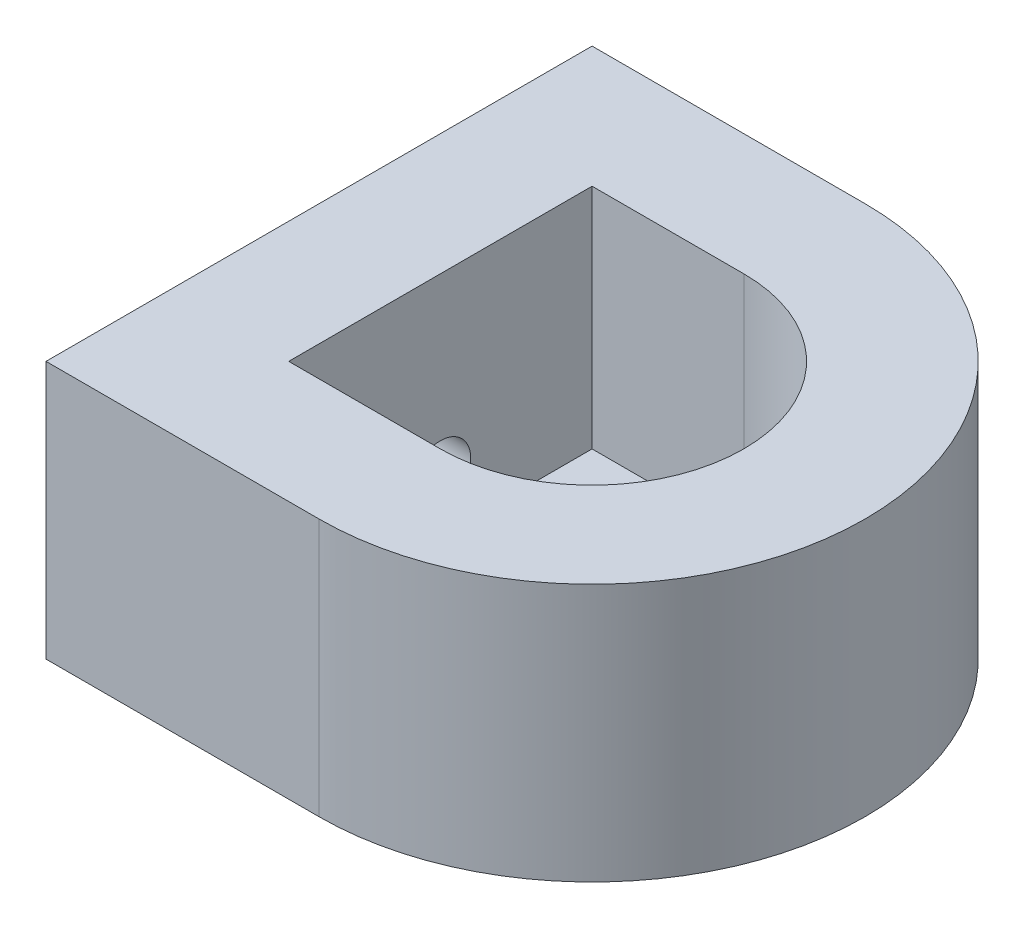
ISO-10303-21;
HEADER;
FILE_DESCRIPTION(('STEP AP214'),'2;1');
FILE_NAME('part.step','',(''),(''),'','','');
FILE_SCHEMA(('AUTOMOTIVE_DESIGN { 1 0 10303 214 1 1 1 1 }'));
ENDSEC;
DATA;
#1=APPLICATION_CONTEXT('core data for automotive mechanical design processes');
#2=APPLICATION_PROTOCOL_DEFINITION('international standard','automotive_design',2000,#1);
#3=PRODUCT_CONTEXT('',#1,'mechanical');
#4=PRODUCT('Part','Part','',(#3));
#5=PRODUCT_RELATED_PRODUCT_CATEGORY('part','',(#4));
#6=PRODUCT_DEFINITION_FORMATION('','',#4);
#7=PRODUCT_DEFINITION_CONTEXT('part definition',#1,'design');
#8=PRODUCT_DEFINITION('design','',#6,#7);
#9=PRODUCT_DEFINITION_SHAPE('','',#8);
#10=(LENGTH_UNIT() NAMED_UNIT(*) SI_UNIT(.MILLI.,.METRE.));
#11=(NAMED_UNIT(*) PLANE_ANGLE_UNIT() SI_UNIT($,.RADIAN.));
#12=(NAMED_UNIT(*) SI_UNIT($,.STERADIAN.) SOLID_ANGLE_UNIT());
#13=UNCERTAINTY_MEASURE_WITH_UNIT(LENGTH_MEASURE(1.E-05),#10,'distance_accuracy_value','');
#14=(GEOMETRIC_REPRESENTATION_CONTEXT(3) GLOBAL_UNCERTAINTY_ASSIGNED_CONTEXT((#13)) GLOBAL_UNIT_ASSIGNED_CONTEXT((#10,
#11,#12)) REPRESENTATION_CONTEXT('',''));
#15=CARTESIAN_POINT('',(0.,0.,0.));
#16=DIRECTION('',(0.,0.,1.));
#17=DIRECTION('',(1.,0.,0.));
#18=AXIS2_PLACEMENT_3D('',#15,#16,#17);
#19=CARTESIAN_POINT('',(0.,-2.,0.));
#20=DIRECTION('',(0.,-1.,0.));
#21=DIRECTION('',(0.,0.,-1.));
#22=AXIS2_PLACEMENT_3D('',#19,#20,#21);
#23=PLANE('',#22);
#24=CARTESIAN_POINT('',(5.00000000000001,-2.,0.));
#25=DIRECTION('',(0.,-1.,0.));
#26=DIRECTION('',(0.,0.,-1.));
#27=AXIS2_PLACEMENT_3D('',#24,#25,#26);
#28=CIRCLE('',#27,3.);
#29=CARTESIAN_POINT('',(5.00000000000001,-2.,-3.));
#30=VERTEX_POINT('',#29);
#31=EDGE_CURVE('E38',#30,#30,#28,.F.);
#32=ORIENTED_EDGE('',*,*,#31,.T.);
#33=EDGE_LOOP('',(#32));
#34=FACE_BOUND('',#33,.T.);
#35=DIRECTION('',(1.,0.,0.));
#36=VECTOR('',#35,1.);
#37=CARTESIAN_POINT('',(-13.,-2.,-18.));
#38=LINE('',#37,#36);
#39=CARTESIAN_POINT('',(-13.,-2.,-18.));
#40=VERTEX_POINT('',#39);
#41=CARTESIAN_POINT('',(5.00000000000001,-2.,-18.));
#42=VERTEX_POINT('',#41);
#43=EDGE_CURVE('E143',#40,#42,#38,.T.);
#44=ORIENTED_EDGE('',*,*,#43,.T.);
#45=CARTESIAN_POINT('',(5.00000000000001,-2.,0.));
#46=DIRECTION('',(0.,-1.,0.));
#47=DIRECTION('',(0.,0.,-1.));
#48=AXIS2_PLACEMENT_3D('',#45,#46,#47);
#49=CIRCLE('',#48,18.);
#50=CARTESIAN_POINT('',(5.00000000000001,-2.,18.));
#51=VERTEX_POINT('',#50);
#52=EDGE_CURVE('E141',#42,#51,#49,.T.);
#53=ORIENTED_EDGE('',*,*,#52,.T.);
#54=DIRECTION('',(1.,0.,0.));
#55=VECTOR('',#54,1.);
#56=CARTESIAN_POINT('',(-13.,-2.,18.));
#57=LINE('',#56,#55);
#58=CARTESIAN_POINT('',(-13.,-2.,18.));
#59=VERTEX_POINT('',#58);
#60=EDGE_CURVE('E138',#59,#51,#57,.T.);
#61=ORIENTED_EDGE('',*,*,#60,.F.);
#62=DIRECTION('',(0.,0.,1.));
#63=VECTOR('',#62,1.);
#64=CARTESIAN_POINT('',(-13.,-2.,-18.));
#65=LINE('',#64,#63);
#66=EDGE_CURVE('E135',#40,#59,#65,.T.);
#67=ORIENTED_EDGE('',*,*,#66,.F.);
#68=EDGE_LOOP('',(#44,#53,#61,#67));
#69=FACE_BOUND('',#68,.T.);
#70=ADVANCED_FACE('F34',(#34,#69),#23,.T.);
#71=CARTESIAN_POINT('',(-4.99999999999999,15.,10.));
#72=DIRECTION('',(0.,0.,-1.));
#73=DIRECTION('',(-1.,0.,0.));
#74=AXIS2_PLACEMENT_3D('',#71,#72,#73);
#75=PLANE('',#74);
#76=DIRECTION('',(1.,0.,0.));
#77=VECTOR('',#76,1.);
#78=CARTESIAN_POINT('',(-4.99999999999999,0.,10.));
#79=LINE('',#78,#77);
#80=CARTESIAN_POINT('',(-4.99999999999999,0.,10.));
#81=VERTEX_POINT('',#80);
#82=CARTESIAN_POINT('',(5.00000000000001,0.,10.));
#83=VERTEX_POINT('',#82);
#84=EDGE_CURVE('E109',#81,#83,#79,.T.);
#85=ORIENTED_EDGE('',*,*,#84,.F.);
#86=DIRECTION('',(0.,-1.,0.));
#87=VECTOR('',#86,1.);
#88=CARTESIAN_POINT('',(-4.99999999999999,15.,10.));
#89=LINE('',#88,#87);
#90=CARTESIAN_POINT('',(-4.99999999999999,15.,10.));
#91=VERTEX_POINT('',#90);
#92=EDGE_CURVE('E102',#91,#81,#89,.T.);
#93=ORIENTED_EDGE('',*,*,#92,.F.);
#94=DIRECTION('',(1.,0.,0.));
#95=VECTOR('',#94,1.);
#96=CARTESIAN_POINT('',(-4.99999999999999,15.,10.));
#97=LINE('',#96,#95);
#98=CARTESIAN_POINT('',(5.00000000000001,15.,10.));
#99=VERTEX_POINT('',#98);
#100=EDGE_CURVE('E106',#91,#99,#97,.T.);
#101=ORIENTED_EDGE('',*,*,#100,.T.);
#102=DIRECTION('',(0.,-1.,0.));
#103=VECTOR('',#102,1.);
#104=CARTESIAN_POINT('',(5.00000000000001,15.,10.));
#105=LINE('',#104,#103);
#106=EDGE_CURVE('E113',#99,#83,#105,.T.);
#107=ORIENTED_EDGE('',*,*,#106,.T.);
#108=EDGE_LOOP('',(#85,#93,#101,#107));
#109=FACE_BOUND('',#108,.T.);
#110=ADVANCED_FACE('F104',(#109),#75,.T.);
#111=CARTESIAN_POINT('',(-4.99999999999999,15.,-10.));
#112=DIRECTION('',(1.,0.,0.));
#113=DIRECTION('',(0.,0.,-1.));
#114=AXIS2_PLACEMENT_3D('',#111,#112,#113);
#115=PLANE('',#114);
#116=CARTESIAN_POINT('',(-4.99999999999999,3.47,0.));
#117=DIRECTION('',(1.,0.,0.));
#118=DIRECTION('',(0.,0.,-1.));
#119=AXIS2_PLACEMENT_3D('',#116,#117,#118);
#120=CIRCLE('',#119,2.);
#121=CARTESIAN_POINT('',(-4.99999999999999,3.47,-2.));
#122=VERTEX_POINT('',#121);
#123=EDGE_CURVE('E43',#122,#122,#120,.T.);
#124=ORIENTED_EDGE('',*,*,#123,.F.);
#125=EDGE_LOOP('',(#124));
#126=FACE_BOUND('',#125,.T.);
#127=DIRECTION('',(0.,0.,1.));
#128=VECTOR('',#127,1.);
#129=CARTESIAN_POINT('',(-4.99999999999999,0.,-10.));
#130=LINE('',#129,#128);
#131=CARTESIAN_POINT('',(-4.99999999999999,0.,-10.));
#132=VERTEX_POINT('',#131);
#133=EDGE_CURVE('E175',#132,#81,#130,.T.);
#134=ORIENTED_EDGE('',*,*,#133,.F.);
#135=DIRECTION('',(0.,-1.,0.));
#136=VECTOR('',#135,1.);
#137=CARTESIAN_POINT('',(-4.99999999999999,15.,-10.));
#138=LINE('',#137,#136);
#139=CARTESIAN_POINT('',(-4.99999999999999,15.,-10.));
#140=VERTEX_POINT('',#139);
#141=EDGE_CURVE('E114',#140,#132,#138,.T.);
#142=ORIENTED_EDGE('',*,*,#141,.F.);
#143=DIRECTION('',(0.,0.,1.));
#144=VECTOR('',#143,1.);
#145=CARTESIAN_POINT('',(-4.99999999999999,15.,-10.));
#146=LINE('',#145,#144);
#147=EDGE_CURVE('E118',#140,#91,#146,.T.);
#148=ORIENTED_EDGE('',*,*,#147,.T.);
#149=ORIENTED_EDGE('',*,*,#92,.T.);
#150=EDGE_LOOP('',(#134,#142,#148,#149));
#151=FACE_BOUND('',#150,.T.);
#152=ADVANCED_FACE('F119',(#126,#151),#115,.T.);
#153=CARTESIAN_POINT('',(-4.99999999999999,15.,-10.));
#154=DIRECTION('',(0.,0.,1.));
#155=DIRECTION('',(1.,0.,0.));
#156=AXIS2_PLACEMENT_3D('',#153,#154,#155);
#157=PLANE('',#156);
#158=DIRECTION('',(-1.,0.,0.));
#159=VECTOR('',#158,1.);
#160=CARTESIAN_POINT('',(-4.99999999999999,0.,-10.));
#161=LINE('',#160,#159);
#162=CARTESIAN_POINT('',(5.,0.,-10.));
#163=VERTEX_POINT('',#162);
#164=EDGE_CURVE('E176',#163,#132,#161,.T.);
#165=ORIENTED_EDGE('',*,*,#164,.F.);
#166=DIRECTION('',(0.,-1.,0.));
#167=VECTOR('',#166,1.);
#168=CARTESIAN_POINT('',(5.,15.,-10.));
#169=LINE('',#168,#167);
#170=CARTESIAN_POINT('',(5.,15.,-10.));
#171=VERTEX_POINT('',#170);
#172=EDGE_CURVE('E170',#171,#163,#169,.T.);
#173=ORIENTED_EDGE('',*,*,#172,.F.);
#174=DIRECTION('',(-1.,0.,0.));
#175=VECTOR('',#174,1.);
#176=CARTESIAN_POINT('',(-4.99999999999999,15.,-10.));
#177=LINE('',#176,#175);
#178=EDGE_CURVE('E122',#171,#140,#177,.T.);
#179=ORIENTED_EDGE('',*,*,#178,.T.);
#180=ORIENTED_EDGE('',*,*,#141,.T.);
#181=EDGE_LOOP('',(#165,#173,#179,#180));
#182=FACE_BOUND('',#181,.T.);
#183=ADVANCED_FACE('F186',(#182),#157,.T.);
#184=CARTESIAN_POINT('',(5.00000000000001,15.,0.));
#185=DIRECTION('',(0.,-1.,0.));
#186=DIRECTION('',(0.,0.,-1.));
#187=AXIS2_PLACEMENT_3D('',#184,#185,#186);
#188=CYLINDRICAL_SURFACE('',#187,10.);
#189=CARTESIAN_POINT('',(5.00000000000001,0.,0.));
#190=DIRECTION('',(0.,1.,0.));
#191=DIRECTION('',(0.,0.,-1.));
#192=AXIS2_PLACEMENT_3D('',#189,#190,#191);
#193=CIRCLE('',#192,10.);
#194=EDGE_CURVE('E130',#83,#163,#193,.T.);
#195=ORIENTED_EDGE('',*,*,#194,.F.);
#196=ORIENTED_EDGE('',*,*,#106,.F.);
#197=CARTESIAN_POINT('',(5.00000000000001,15.,0.));
#198=DIRECTION('',(0.,1.,0.));
#199=DIRECTION('',(0.,0.,-1.));
#200=AXIS2_PLACEMENT_3D('',#197,#198,#199);
#201=CIRCLE('',#200,10.);
#202=EDGE_CURVE('E126',#99,#171,#201,.T.);
#203=ORIENTED_EDGE('',*,*,#202,.T.);
#204=ORIENTED_EDGE('',*,*,#172,.T.);
#205=EDGE_LOOP('',(#195,#196,#203,#204));
#206=FACE_BOUND('',#205,.T.);
#207=ADVANCED_FACE('F183',(#206),#188,.F.);
#208=CARTESIAN_POINT('',(5.00000000000001,0.,0.));
#209=DIRECTION('',(0.,-1.,0.));
#210=DIRECTION('',(0.,0.,-1.));
#211=AXIS2_PLACEMENT_3D('',#208,#209,#210);
#212=PLANE('',#211);
#213=CARTESIAN_POINT('',(5.00000000000001,0.,0.));
#214=DIRECTION('',(0.,-1.,0.));
#215=DIRECTION('',(0.,0.,-1.));
#216=AXIS2_PLACEMENT_3D('',#213,#214,#215);
#217=CIRCLE('',#216,3.);
#218=CARTESIAN_POINT('',(5.00000000000001,0.,-3.));
#219=VERTEX_POINT('',#218);
#220=EDGE_CURVE('E145',#219,#219,#217,.T.);
#221=ORIENTED_EDGE('',*,*,#220,.T.);
#222=EDGE_LOOP('',(#221));
#223=FACE_BOUND('',#222,.T.);
#224=ORIENTED_EDGE('',*,*,#194,.T.);
#225=ORIENTED_EDGE('',*,*,#164,.T.);
#226=ORIENTED_EDGE('',*,*,#133,.T.);
#227=ORIENTED_EDGE('',*,*,#84,.T.);
#228=EDGE_LOOP('',(#224,#225,#226,#227));
#229=FACE_BOUND('',#228,.T.);
#230=ADVANCED_FACE('F181',(#223,#229),#212,.F.);
#231=CARTESIAN_POINT('',(5.00000000000001,15.,0.));
#232=DIRECTION('',(0.,-1.,0.));
#233=DIRECTION('',(0.,0.,-1.));
#234=AXIS2_PLACEMENT_3D('',#231,#232,#233);
#235=CYLINDRICAL_SURFACE('',#234,3.);
#236=ORIENTED_EDGE('',*,*,#220,.F.);
#237=EDGE_LOOP('',(#236));
#238=FACE_BOUND('',#237,.T.);
#239=ORIENTED_EDGE('',*,*,#31,.F.);
#240=EDGE_LOOP('',(#239));
#241=FACE_BOUND('',#240,.T.);
#242=ADVANCED_FACE('F36',(#238,#241),#235,.F.);
#243=CARTESIAN_POINT('',(5.00000000000001,15.,0.));
#244=DIRECTION('',(0.,-1.,0.));
#245=DIRECTION('',(0.,0.,-1.));
#246=AXIS2_PLACEMENT_3D('',#243,#244,#245);
#247=CYLINDRICAL_SURFACE('',#246,18.);
#248=DIRECTION('',(0.,-1.,0.));
#249=VECTOR('',#248,1.);
#250=CARTESIAN_POINT('',(5.00000000000001,15.,18.));
#251=LINE('',#250,#249);
#252=CARTESIAN_POINT('',(5.00000000000001,15.,18.));
#253=VERTEX_POINT('',#252);
#254=EDGE_CURVE('E57',#253,#51,#251,.T.);
#255=ORIENTED_EDGE('',*,*,#254,.T.);
#256=ORIENTED_EDGE('',*,*,#52,.F.);
#257=DIRECTION('',(0.,-1.,0.));
#258=VECTOR('',#257,1.);
#259=CARTESIAN_POINT('',(5.,15.,-18.));
#260=LINE('',#259,#258);
#261=CARTESIAN_POINT('',(5.,15.,-18.));
#262=VERTEX_POINT('',#261);
#263=EDGE_CURVE('E50',#262,#42,#260,.T.);
#264=ORIENTED_EDGE('',*,*,#263,.F.);
#265=CARTESIAN_POINT('',(5.00000000000001,15.,0.));
#266=DIRECTION('',(0.,1.,0.));
#267=DIRECTION('',(0.,0.,-1.));
#268=AXIS2_PLACEMENT_3D('',#265,#266,#267);
#269=CIRCLE('',#268,18.);
#270=EDGE_CURVE('E163',#253,#262,#269,.T.);
#271=ORIENTED_EDGE('',*,*,#270,.F.);
#272=EDGE_LOOP('',(#255,#256,#264,#271));
#273=FACE_BOUND('',#272,.T.);
#274=ADVANCED_FACE('F228',(#273),#247,.T.);
#275=CARTESIAN_POINT('',(5.00000000000001,15.,0.));
#276=DIRECTION('',(0.,-1.,0.));
#277=DIRECTION('',(0.,0.,-1.));
#278=AXIS2_PLACEMENT_3D('',#275,#276,#277);
#279=PLANE('',#278);
#280=DIRECTION('',(0.,0.,1.));
#281=VECTOR('',#280,1.);
#282=CARTESIAN_POINT('',(-13.,15.,-18.));
#283=LINE('',#282,#281);
#284=CARTESIAN_POINT('',(-13.,15.,-18.));
#285=VERTEX_POINT('',#284);
#286=CARTESIAN_POINT('',(-13.,15.,18.));
#287=VERTEX_POINT('',#286);
#288=EDGE_CURVE('E167',#285,#287,#283,.T.);
#289=ORIENTED_EDGE('',*,*,#288,.T.);
#290=DIRECTION('',(1.,0.,0.));
#291=VECTOR('',#290,1.);
#292=CARTESIAN_POINT('',(-13.,15.,18.));
#293=LINE('',#292,#291);
#294=EDGE_CURVE('E165',#287,#253,#293,.T.);
#295=ORIENTED_EDGE('',*,*,#294,.T.);
#296=ORIENTED_EDGE('',*,*,#270,.T.);
#297=DIRECTION('',(-1.,0.,0.));
#298=VECTOR('',#297,1.);
#299=CARTESIAN_POINT('',(-13.,15.,-18.));
#300=LINE('',#299,#298);
#301=EDGE_CURVE('E161',#262,#285,#300,.T.);
#302=ORIENTED_EDGE('',*,*,#301,.T.);
#303=EDGE_LOOP('',(#289,#295,#296,#302));
#304=FACE_BOUND('',#303,.T.);
#305=ORIENTED_EDGE('',*,*,#202,.F.);
#306=ORIENTED_EDGE('',*,*,#100,.F.);
#307=ORIENTED_EDGE('',*,*,#147,.F.);
#308=ORIENTED_EDGE('',*,*,#178,.F.);
#309=EDGE_LOOP('',(#305,#306,#307,#308));
#310=FACE_BOUND('',#309,.T.);
#311=ADVANCED_FACE('F125',(#304,#310),#279,.F.);
#312=CARTESIAN_POINT('',(-13.,15.,18.));
#313=DIRECTION('',(0.,0.,-1.));
#314=DIRECTION('',(-1.,0.,0.));
#315=AXIS2_PLACEMENT_3D('',#312,#313,#314);
#316=PLANE('',#315);
#317=DIRECTION('',(0.,-1.,0.));
#318=VECTOR('',#317,1.);
#319=CARTESIAN_POINT('',(-13.,15.,18.));
#320=LINE('',#319,#318);
#321=EDGE_CURVE('E155',#287,#59,#320,.T.);
#322=ORIENTED_EDGE('',*,*,#321,.T.);
#323=ORIENTED_EDGE('',*,*,#60,.T.);
#324=ORIENTED_EDGE('',*,*,#254,.F.);
#325=ORIENTED_EDGE('',*,*,#294,.F.);
#326=EDGE_LOOP('',(#322,#323,#324,#325));
#327=FACE_BOUND('',#326,.T.);
#328=ADVANCED_FACE('F216',(#327),#316,.F.);
#329=CARTESIAN_POINT('',(-13.,15.,-18.));
#330=DIRECTION('',(0.,0.,1.));
#331=DIRECTION('',(1.,0.,0.));
#332=AXIS2_PLACEMENT_3D('',#329,#330,#331);
#333=PLANE('',#332);
#334=ORIENTED_EDGE('',*,*,#263,.T.);
#335=ORIENTED_EDGE('',*,*,#43,.F.);
#336=DIRECTION('',(0.,-1.,0.));
#337=VECTOR('',#336,1.);
#338=CARTESIAN_POINT('',(-13.,15.,-18.));
#339=LINE('',#338,#337);
#340=EDGE_CURVE('E159',#285,#40,#339,.T.);
#341=ORIENTED_EDGE('',*,*,#340,.F.);
#342=ORIENTED_EDGE('',*,*,#301,.F.);
#343=EDGE_LOOP('',(#334,#335,#341,#342));
#344=FACE_BOUND('',#343,.T.);
#345=ADVANCED_FACE('F208',(#344),#333,.F.);
#346=CARTESIAN_POINT('',(7.00000000000001,3.47,0.));
#347=DIRECTION('',(-1.,0.,0.));
#348=DIRECTION('',(0.,0.,1.));
#349=AXIS2_PLACEMENT_3D('',#346,#347,#348);
#350=CYLINDRICAL_SURFACE('',#349,2.);
#351=ORIENTED_EDGE('',*,*,#123,.T.);
#352=EDGE_LOOP('',(#351));
#353=FACE_BOUND('',#352,.T.);
#354=CARTESIAN_POINT('',(-13.,3.47,0.));
#355=DIRECTION('',(-1.,0.,0.));
#356=DIRECTION('',(0.,0.,1.));
#357=AXIS2_PLACEMENT_3D('',#354,#355,#356);
#358=CIRCLE('',#357,2.);
#359=CARTESIAN_POINT('',(-13.,3.47,2.));
#360=VERTEX_POINT('',#359);
#361=EDGE_CURVE('E11',#360,#360,#358,.T.);
#362=ORIENTED_EDGE('',*,*,#361,.T.);
#363=EDGE_LOOP('',(#362));
#364=FACE_BOUND('',#363,.T.);
#365=ADVANCED_FACE('F206',(#353,#364),#350,.F.);
#366=CARTESIAN_POINT('',(-13.,15.,-18.));
#367=DIRECTION('',(1.,0.,0.));
#368=DIRECTION('',(0.,0.,-1.));
#369=AXIS2_PLACEMENT_3D('',#366,#367,#368);
#370=PLANE('',#369);
#371=ORIENTED_EDGE('',*,*,#361,.F.);
#372=EDGE_LOOP('',(#371));
#373=FACE_BOUND('',#372,.T.);
#374=ORIENTED_EDGE('',*,*,#340,.T.);
#375=ORIENTED_EDGE('',*,*,#66,.T.);
#376=ORIENTED_EDGE('',*,*,#321,.F.);
#377=ORIENTED_EDGE('',*,*,#288,.F.);
#378=EDGE_LOOP('',(#374,#375,#376,#377));
#379=FACE_BOUND('',#378,.T.);
#380=ADVANCED_FACE('F202',(#373,#379),#370,.F.);
#381=CLOSED_SHELL('',(#70,#110,#152,#183,#207,#230,#242,#274,#311,#328,#345,#365,#380));
#382=MANIFOLD_SOLID_BREP('B2',#381);
#383=ADVANCED_BREP_SHAPE_REPRESENTATION('',(#18,#382),#14);
#384=SHAPE_DEFINITION_REPRESENTATION(#9,#383);
ENDSEC;
END-ISO-10303-21;
